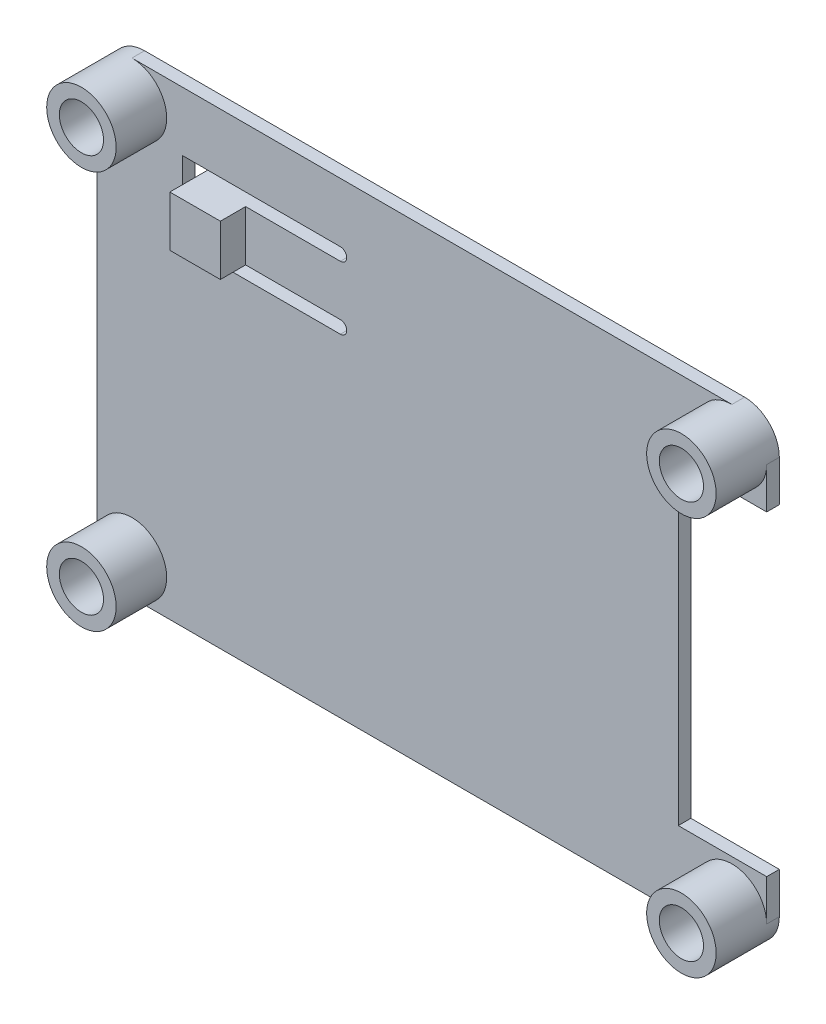
ISO-10303-21;
HEADER;
FILE_DESCRIPTION(('STEP AP214'),'2;1');
FILE_NAME('part.step','',(''),(''),'','','');
FILE_SCHEMA(('AUTOMOTIVE_DESIGN { 1 0 10303 214 1 1 1 1 }'));
ENDSEC;
DATA;
#1=APPLICATION_CONTEXT('core data for automotive mechanical design processes');
#2=APPLICATION_PROTOCOL_DEFINITION('international standard','automotive_design',2000,#1);
#3=PRODUCT_CONTEXT('',#1,'mechanical');
#4=PRODUCT('Part','Part','',(#3));
#5=PRODUCT_RELATED_PRODUCT_CATEGORY('part','',(#4));
#6=PRODUCT_DEFINITION_FORMATION('','',#4);
#7=PRODUCT_DEFINITION_CONTEXT('part definition',#1,'design');
#8=PRODUCT_DEFINITION('design','',#6,#7);
#9=PRODUCT_DEFINITION_SHAPE('','',#8);
#10=(LENGTH_UNIT() NAMED_UNIT(*) SI_UNIT(.MILLI.,.METRE.));
#11=(NAMED_UNIT(*) PLANE_ANGLE_UNIT() SI_UNIT($,.RADIAN.));
#12=(NAMED_UNIT(*) SI_UNIT($,.STERADIAN.) SOLID_ANGLE_UNIT());
#13=UNCERTAINTY_MEASURE_WITH_UNIT(LENGTH_MEASURE(1.E-05),#10,'distance_accuracy_value','');
#14=(GEOMETRIC_REPRESENTATION_CONTEXT(3) GLOBAL_UNCERTAINTY_ASSIGNED_CONTEXT((#13)) GLOBAL_UNIT_ASSIGNED_CONTEXT((#10,
#11,#12)) REPRESENTATION_CONTEXT('',''));
#15=CARTESIAN_POINT('',(0.,0.,0.));
#16=DIRECTION('',(0.,0.,1.));
#17=DIRECTION('',(1.,0.,0.));
#18=AXIS2_PLACEMENT_3D('',#15,#16,#17);
#19=CARTESIAN_POINT('',(0.,0.,1.));
#20=DIRECTION('',(0.,0.,1.));
#21=DIRECTION('',(1.,0.,0.));
#22=AXIS2_PLACEMENT_3D('',#19,#20,#21);
#23=PLANE('',#22);
#24=DIRECTION('',(1.,0.,0.));
#25=VECTOR('',#24,1.);
#26=CARTESIAN_POINT('',(19.5,-12.5,1.));
#27=LINE('',#26,#25);
#28=CARTESIAN_POINT('',(19.5,-12.5,1.));
#29=VERTEX_POINT('',#28);
#30=CARTESIAN_POINT('',(26.5,-12.5,1.));
#31=VERTEX_POINT('',#30);
#32=EDGE_CURVE('E270',#29,#31,#27,.T.);
#33=ORIENTED_EDGE('',*,*,#32,.F.);
#34=DIRECTION('',(0.,-1.,0.));
#35=VECTOR('',#34,1.);
#36=CARTESIAN_POINT('',(19.5,-12.5,1.));
#37=LINE('',#36,#35);
#38=CARTESIAN_POINT('',(19.5,12.5,1.));
#39=VERTEX_POINT('',#38);
#40=EDGE_CURVE('E267',#39,#29,#37,.T.);
#41=ORIENTED_EDGE('',*,*,#40,.F.);
#42=DIRECTION('',(-1.,0.,0.));
#43=VECTOR('',#42,1.);
#44=CARTESIAN_POINT('',(19.5,12.5,1.));
#45=LINE('',#44,#43);
#46=CARTESIAN_POINT('',(26.5,12.5,1.));
#47=VERTEX_POINT('',#46);
#48=EDGE_CURVE('E264',#47,#39,#45,.T.);
#49=ORIENTED_EDGE('',*,*,#48,.F.);
#50=DIRECTION('',(0.,-1.,0.));
#51=VECTOR('',#50,1.);
#52=CARTESIAN_POINT('',(26.5,0.,1.));
#53=LINE('',#52,#51);
#54=CARTESIAN_POINT('',(26.5,15.75,1.));
#55=VERTEX_POINT('',#54);
#56=EDGE_CURVE('E325',#55,#47,#53,.T.);
#57=ORIENTED_EDGE('',*,*,#56,.F.);
#58=CARTESIAN_POINT('',(23.75,15.75,1.));
#59=DIRECTION('',(0.,0.,1.));
#60=DIRECTION('',(1.,0.,0.));
#61=AXIS2_PLACEMENT_3D('',#58,#59,#60);
#62=CIRCLE('',#61,2.75);
#63=CARTESIAN_POINT('',(23.75,18.5,1.));
#64=VERTEX_POINT('',#63);
#65=EDGE_CURVE('E305',#64,#55,#62,.T.);
#66=ORIENTED_EDGE('',*,*,#65,.F.);
#67=DIRECTION('',(1.,0.,0.));
#68=VECTOR('',#67,1.);
#69=CARTESIAN_POINT('',(0.,18.5,1.));
#70=LINE('',#69,#68);
#71=CARTESIAN_POINT('',(-23.75,18.5,1.));
#72=VERTEX_POINT('',#71);
#73=EDGE_CURVE('E328',#72,#64,#70,.T.);
#74=ORIENTED_EDGE('',*,*,#73,.F.);
#75=CARTESIAN_POINT('',(-23.75,15.75,1.));
#76=DIRECTION('',(0.,0.,1.));
#77=DIRECTION('',(1.,0.,0.));
#78=AXIS2_PLACEMENT_3D('',#75,#76,#77);
#79=CIRCLE('',#78,2.75);
#80=CARTESIAN_POINT('',(-26.5,15.75,1.));
#81=VERTEX_POINT('',#80);
#82=EDGE_CURVE('E314',#72,#81,#79,.F.);
#83=ORIENTED_EDGE('',*,*,#82,.T.);
#84=DIRECTION('',(0.,-1.,0.));
#85=VECTOR('',#84,1.);
#86=CARTESIAN_POINT('',(-26.5,0.,1.));
#87=LINE('',#86,#85);
#88=CARTESIAN_POINT('',(-26.5,-15.75,1.));
#89=VERTEX_POINT('',#88);
#90=EDGE_CURVE('E317',#81,#89,#87,.T.);
#91=ORIENTED_EDGE('',*,*,#90,.T.);
#92=CARTESIAN_POINT('',(-23.75,-15.75,1.));
#93=DIRECTION('',(0.,0.,1.));
#94=DIRECTION('',(1.,0.,0.));
#95=AXIS2_PLACEMENT_3D('',#92,#93,#94);
#96=CIRCLE('',#95,2.75);
#97=CARTESIAN_POINT('',(-23.75,-18.5,1.));
#98=VERTEX_POINT('',#97);
#99=EDGE_CURVE('E287',#98,#89,#96,.T.);
#100=ORIENTED_EDGE('',*,*,#99,.F.);
#101=DIRECTION('',(-1.,0.,0.));
#102=VECTOR('',#101,1.);
#103=CARTESIAN_POINT('',(0.,-18.5,1.));
#104=LINE('',#103,#102);
#105=CARTESIAN_POINT('',(23.75,-18.5,1.));
#106=VERTEX_POINT('',#105);
#107=EDGE_CURVE('E320',#106,#98,#104,.T.);
#108=ORIENTED_EDGE('',*,*,#107,.F.);
#109=CARTESIAN_POINT('',(23.75,-15.75,1.));
#110=DIRECTION('',(0.,0.,1.));
#111=DIRECTION('',(1.,0.,0.));
#112=AXIS2_PLACEMENT_3D('',#109,#110,#111);
#113=CIRCLE('',#112,2.75);
#114=CARTESIAN_POINT('',(26.5,-15.75,1.));
#115=VERTEX_POINT('',#114);
#116=EDGE_CURVE('E296',#106,#115,#113,.F.);
#117=ORIENTED_EDGE('',*,*,#116,.T.);
#118=EDGE_CURVE('E324',#31,#115,#53,.T.);
#119=ORIENTED_EDGE('',*,*,#118,.F.);
#120=EDGE_LOOP('',(#33,#41,#49,#57,#66,#74,#83,#91,#100,#108,#117,#119));
#121=FACE_BOUND('',#120,.T.);
#122=DIRECTION('',(1.,0.,0.));
#123=VECTOR('',#122,1.);
#124=CARTESIAN_POINT('',(0.,12.8143313428144,1.));
#125=LINE('',#124,#123);
#126=CARTESIAN_POINT('',(-14.75,12.8143313428144,1.));
#127=VERTEX_POINT('',#126);
#128=CARTESIAN_POINT('',(-7.25,12.8143313428144,1.));
#129=VERTEX_POINT('',#128);
#130=EDGE_CURVE('E237',#127,#129,#125,.T.);
#131=ORIENTED_EDGE('',*,*,#130,.F.);
#132=DIRECTION('',(0.,1.,0.));
#133=VECTOR('',#132,1.);
#134=CARTESIAN_POINT('',(-14.75,8.8143313428144,1.));
#135=LINE('',#134,#133);
#136=CARTESIAN_POINT('',(-14.75,8.8143313428144,1.));
#137=VERTEX_POINT('',#136);
#138=EDGE_CURVE('E51',#137,#127,#135,.T.);
#139=ORIENTED_EDGE('',*,*,#138,.F.);
#140=DIRECTION('',(-1.,0.,0.));
#141=VECTOR('',#140,1.);
#142=CARTESIAN_POINT('',(0.,8.81433134281439,1.));
#143=LINE('',#142,#141);
#144=CARTESIAN_POINT('',(-7.25,8.81433134281439,1.));
#145=VERTEX_POINT('',#144);
#146=EDGE_CURVE('E251',#145,#137,#143,.T.);
#147=ORIENTED_EDGE('',*,*,#146,.F.);
#148=CARTESIAN_POINT('',(-7.25,8.3143313428144,1.));
#149=DIRECTION('',(0.,0.,1.));
#150=DIRECTION('',(1.,0.,0.));
#151=AXIS2_PLACEMENT_3D('',#148,#149,#150);
#152=CIRCLE('',#151,0.5);
#153=CARTESIAN_POINT('',(-7.25,7.8143313428144,1.));
#154=VERTEX_POINT('',#153);
#155=EDGE_CURVE('E254',#154,#145,#152,.T.);
#156=ORIENTED_EDGE('',*,*,#155,.F.);
#157=DIRECTION('',(1.,0.,0.));
#158=VECTOR('',#157,1.);
#159=CARTESIAN_POINT('',(0.,7.81433134281439,1.));
#160=LINE('',#159,#158);
#161=CARTESIAN_POINT('',(-19.75,7.8143313428144,1.));
#162=VERTEX_POINT('',#161);
#163=EDGE_CURVE('E256',#162,#154,#160,.T.);
#164=ORIENTED_EDGE('',*,*,#163,.F.);
#165=DIRECTION('',(0.,-1.,0.));
#166=VECTOR('',#165,1.);
#167=CARTESIAN_POINT('',(-19.75,0.,1.));
#168=LINE('',#167,#166);
#169=CARTESIAN_POINT('',(-19.75,13.8143313428144,1.));
#170=VERTEX_POINT('',#169);
#171=EDGE_CURVE('E258',#170,#162,#168,.T.);
#172=ORIENTED_EDGE('',*,*,#171,.F.);
#173=DIRECTION('',(-1.,0.,0.));
#174=VECTOR('',#173,1.);
#175=CARTESIAN_POINT('',(0.,13.8143313428144,1.));
#176=LINE('',#175,#174);
#177=CARTESIAN_POINT('',(-7.25,13.8143313428144,1.));
#178=VERTEX_POINT('',#177);
#179=EDGE_CURVE('E260',#178,#170,#176,.T.);
#180=ORIENTED_EDGE('',*,*,#179,.F.);
#181=CARTESIAN_POINT('',(-7.25,13.3143313428144,1.));
#182=DIRECTION('',(0.,0.,1.));
#183=DIRECTION('',(1.,0.,0.));
#184=AXIS2_PLACEMENT_3D('',#181,#182,#183);
#185=CIRCLE('',#184,0.5);
#186=EDGE_CURVE('E262',#129,#178,#185,.T.);
#187=ORIENTED_EDGE('',*,*,#186,.F.);
#188=EDGE_LOOP('',(#131,#139,#147,#156,#164,#172,#180,#187));
#189=FACE_BOUND('',#188,.T.);
#190=ADVANCED_FACE('F36',(#121,#189),#23,.T.);
#191=CARTESIAN_POINT('',(26.5,0.,1.));
#192=DIRECTION('',(1.,0.,0.));
#193=DIRECTION('',(0.,0.,-1.));
#194=AXIS2_PLACEMENT_3D('',#191,#192,#193);
#195=PLANE('',#194);
#196=DIRECTION('',(0.,0.,1.));
#197=VECTOR('',#196,1.);
#198=CARTESIAN_POINT('',(26.5,-12.5,-5.));
#199=LINE('',#198,#197);
#200=CARTESIAN_POINT('',(26.5,-12.5,0.));
#201=VERTEX_POINT('',#200);
#202=EDGE_CURVE('E273',#201,#31,#199,.T.);
#203=ORIENTED_EDGE('',*,*,#202,.T.);
#204=ORIENTED_EDGE('',*,*,#118,.T.);
#205=DIRECTION('',(0.,0.,-1.));
#206=VECTOR('',#205,1.);
#207=CARTESIAN_POINT('',(26.5,-15.75,1.));
#208=LINE('',#207,#206);
#209=CARTESIAN_POINT('',(26.5,-15.75,0.));
#210=VERTEX_POINT('',#209);
#211=EDGE_CURVE('E374',#115,#210,#208,.T.);
#212=ORIENTED_EDGE('',*,*,#211,.T.);
#213=DIRECTION('',(0.,-1.,0.));
#214=VECTOR('',#213,1.);
#215=CARTESIAN_POINT('',(26.5,0.,0.));
#216=LINE('',#215,#214);
#217=EDGE_CURVE('E343',#201,#210,#216,.T.);
#218=ORIENTED_EDGE('',*,*,#217,.F.);
#219=EDGE_LOOP('',(#203,#204,#212,#218));
#220=FACE_BOUND('',#219,.T.);
#221=ADVANCED_FACE('F400',(#220),#195,.T.);
#222=CARTESIAN_POINT('',(-26.5,0.,1.));
#223=DIRECTION('',(1.,0.,0.));
#224=DIRECTION('',(0.,1.,0.));
#225=AXIS2_PLACEMENT_3D('',#222,#223,#224);
#226=PLANE('',#225);
#227=DIRECTION('',(0.,-1.,0.));
#228=VECTOR('',#227,1.);
#229=CARTESIAN_POINT('',(-26.5,0.,0.));
#230=LINE('',#229,#228);
#231=CARTESIAN_POINT('',(-26.5,15.75,0.));
#232=VERTEX_POINT('',#231);
#233=CARTESIAN_POINT('',(-26.5,-15.75,0.));
#234=VERTEX_POINT('',#233);
#235=EDGE_CURVE('E316',#232,#234,#230,.T.);
#236=ORIENTED_EDGE('',*,*,#235,.T.);
#237=DIRECTION('',(0.,0.,-1.));
#238=VECTOR('',#237,1.);
#239=CARTESIAN_POINT('',(-26.5,-15.75,1.));
#240=LINE('',#239,#238);
#241=EDGE_CURVE('E381',#89,#234,#240,.T.);
#242=ORIENTED_EDGE('',*,*,#241,.F.);
#243=ORIENTED_EDGE('',*,*,#90,.F.);
#244=DIRECTION('',(0.,0.,-1.));
#245=VECTOR('',#244,1.);
#246=CARTESIAN_POINT('',(-26.5,15.75,1.));
#247=LINE('',#246,#245);
#248=EDGE_CURVE('E331',#81,#232,#247,.T.);
#249=ORIENTED_EDGE('',*,*,#248,.T.);
#250=EDGE_LOOP('',(#236,#242,#243,#249));
#251=FACE_BOUND('',#250,.T.);
#252=ADVANCED_FACE('F38',(#251),#226,.F.);
#253=CARTESIAN_POINT('',(-23.75,-15.75,1.));
#254=DIRECTION('',(0.,0.,-1.));
#255=DIRECTION('',(-1.,0.,0.));
#256=AXIS2_PLACEMENT_3D('',#253,#254,#255);
#257=CYLINDRICAL_SURFACE('',#256,2.75);
#258=CARTESIAN_POINT('',(-23.75,-15.75,0.));
#259=DIRECTION('',(0.,0.,1.));
#260=DIRECTION('',(1.,0.,0.));
#261=AXIS2_PLACEMENT_3D('',#258,#259,#260);
#262=CIRCLE('',#261,2.75);
#263=CARTESIAN_POINT('',(-23.75,-18.5,0.));
#264=VERTEX_POINT('',#263);
#265=EDGE_CURVE('E334',#264,#234,#262,.F.);
#266=ORIENTED_EDGE('',*,*,#265,.F.);
#267=DIRECTION('',(0.,0.,-1.));
#268=VECTOR('',#267,1.);
#269=CARTESIAN_POINT('',(-23.75,-18.5,1.));
#270=LINE('',#269,#268);
#271=EDGE_CURVE('E379',#98,#264,#270,.T.);
#272=ORIENTED_EDGE('',*,*,#271,.F.);
#273=ORIENTED_EDGE('',*,*,#99,.T.);
#274=ORIENTED_EDGE('',*,*,#241,.T.);
#275=EDGE_LOOP('',(#266,#272,#273,#274));
#276=FACE_BOUND('',#275,.T.);
#277=CARTESIAN_POINT('',(-23.75,-15.75,5.));
#278=DIRECTION('',(0.,0.,1.));
#279=DIRECTION('',(1.,0.,0.));
#280=AXIS2_PLACEMENT_3D('',#277,#278,#279);
#281=CIRCLE('',#280,2.75);
#282=CARTESIAN_POINT('',(-21.,-15.75,5.));
#283=VERTEX_POINT('',#282);
#284=EDGE_CURVE('E276',#283,#283,#281,.F.);
#285=ORIENTED_EDGE('',*,*,#284,.T.);
#286=EDGE_LOOP('',(#285));
#287=FACE_BOUND('',#286,.T.);
#288=ADVANCED_FACE('F416',(#276,#287),#257,.T.);
#289=CARTESIAN_POINT('',(0.,-18.5,1.));
#290=DIRECTION('',(0.,-1.,0.));
#291=DIRECTION('',(1.,0.,0.));
#292=AXIS2_PLACEMENT_3D('',#289,#290,#291);
#293=PLANE('',#292);
#294=DIRECTION('',(-1.,0.,0.));
#295=VECTOR('',#294,1.);
#296=CARTESIAN_POINT('',(0.,-18.5,0.));
#297=LINE('',#296,#295);
#298=CARTESIAN_POINT('',(23.75,-18.5,0.));
#299=VERTEX_POINT('',#298);
#300=EDGE_CURVE('E337',#299,#264,#297,.T.);
#301=ORIENTED_EDGE('',*,*,#300,.F.);
#302=DIRECTION('',(0.,0.,-1.));
#303=VECTOR('',#302,1.);
#304=CARTESIAN_POINT('',(23.75,-18.5,1.));
#305=LINE('',#304,#303);
#306=EDGE_CURVE('E377',#106,#299,#305,.T.);
#307=ORIENTED_EDGE('',*,*,#306,.F.);
#308=ORIENTED_EDGE('',*,*,#107,.T.);
#309=ORIENTED_EDGE('',*,*,#271,.T.);
#310=EDGE_LOOP('',(#301,#307,#308,#309));
#311=FACE_BOUND('',#310,.T.);
#312=ADVANCED_FACE('F412',(#311),#293,.T.);
#313=CARTESIAN_POINT('',(23.75,-15.75,1.));
#314=DIRECTION('',(0.,0.,-1.));
#315=DIRECTION('',(-1.,0.,0.));
#316=AXIS2_PLACEMENT_3D('',#313,#314,#315);
#317=CYLINDRICAL_SURFACE('',#316,2.75);
#318=CARTESIAN_POINT('',(23.75,-15.75,0.));
#319=DIRECTION('',(0.,0.,1.));
#320=DIRECTION('',(1.,0.,0.));
#321=AXIS2_PLACEMENT_3D('',#318,#319,#320);
#322=CIRCLE('',#321,2.75);
#323=EDGE_CURVE('E340',#299,#210,#322,.T.);
#324=ORIENTED_EDGE('',*,*,#323,.T.);
#325=ORIENTED_EDGE('',*,*,#211,.F.);
#326=ORIENTED_EDGE('',*,*,#116,.F.);
#327=ORIENTED_EDGE('',*,*,#306,.T.);
#328=EDGE_LOOP('',(#324,#325,#326,#327));
#329=FACE_BOUND('',#328,.T.);
#330=CARTESIAN_POINT('',(23.75,-15.75,5.));
#331=DIRECTION('',(0.,0.,1.));
#332=DIRECTION('',(1.,0.,0.));
#333=AXIS2_PLACEMENT_3D('',#330,#331,#332);
#334=CIRCLE('',#333,2.75);
#335=CARTESIAN_POINT('',(26.5,-15.75,5.));
#336=VERTEX_POINT('',#335);
#337=EDGE_CURVE('E293',#336,#336,#334,.T.);
#338=ORIENTED_EDGE('',*,*,#337,.F.);
#339=EDGE_LOOP('',(#338));
#340=FACE_BOUND('',#339,.T.);
#341=ADVANCED_FACE('F407',(#329,#340),#317,.T.);
#342=DIRECTION('',(0.,0.,1.));
#343=VECTOR('',#342,1.);
#344=CARTESIAN_POINT('',(26.5,12.5,-5.));
#345=LINE('',#344,#343);
#346=CARTESIAN_POINT('',(26.5,12.5,0.));
#347=VERTEX_POINT('',#346);
#348=EDGE_CURVE('E272',#347,#47,#345,.T.);
#349=ORIENTED_EDGE('',*,*,#348,.F.);
#350=CARTESIAN_POINT('',(26.5,15.75,0.));
#351=VERTEX_POINT('',#350);
#352=EDGE_CURVE('E344',#351,#347,#216,.T.);
#353=ORIENTED_EDGE('',*,*,#352,.F.);
#354=DIRECTION('',(0.,0.,-1.));
#355=VECTOR('',#354,1.);
#356=CARTESIAN_POINT('',(26.5,15.75,1.));
#357=LINE('',#356,#355);
#358=EDGE_CURVE('E372',#55,#351,#357,.T.);
#359=ORIENTED_EDGE('',*,*,#358,.F.);
#360=ORIENTED_EDGE('',*,*,#56,.T.);
#361=EDGE_LOOP('',(#349,#353,#359,#360));
#362=FACE_BOUND('',#361,.T.);
#363=ADVANCED_FACE('F441',(#362),#195,.T.);
#364=CARTESIAN_POINT('',(23.75,15.75,1.));
#365=DIRECTION('',(0.,0.,-1.));
#366=DIRECTION('',(-1.,0.,0.));
#367=AXIS2_PLACEMENT_3D('',#364,#365,#366);
#368=CYLINDRICAL_SURFACE('',#367,2.75);
#369=CARTESIAN_POINT('',(23.75,15.75,0.));
#370=DIRECTION('',(0.,0.,1.));
#371=DIRECTION('',(1.,0.,0.));
#372=AXIS2_PLACEMENT_3D('',#369,#370,#371);
#373=CIRCLE('',#372,2.75);
#374=CARTESIAN_POINT('',(23.75,18.5,0.));
#375=VERTEX_POINT('',#374);
#376=EDGE_CURVE('E347',#375,#351,#373,.F.);
#377=ORIENTED_EDGE('',*,*,#376,.F.);
#378=DIRECTION('',(0.,0.,-1.));
#379=VECTOR('',#378,1.);
#380=CARTESIAN_POINT('',(23.75,18.5,1.));
#381=LINE('',#380,#379);
#382=EDGE_CURVE('E370',#64,#375,#381,.T.);
#383=ORIENTED_EDGE('',*,*,#382,.F.);
#384=ORIENTED_EDGE('',*,*,#65,.T.);
#385=ORIENTED_EDGE('',*,*,#358,.T.);
#386=EDGE_LOOP('',(#377,#383,#384,#385));
#387=FACE_BOUND('',#386,.T.);
#388=CARTESIAN_POINT('',(23.75,15.75,5.));
#389=DIRECTION('',(0.,0.,1.));
#390=DIRECTION('',(1.,0.,0.));
#391=AXIS2_PLACEMENT_3D('',#388,#389,#390);
#392=CIRCLE('',#391,2.75);
#393=CARTESIAN_POINT('',(26.5,15.75,5.));
#394=VERTEX_POINT('',#393);
#395=EDGE_CURVE('E299',#394,#394,#392,.F.);
#396=ORIENTED_EDGE('',*,*,#395,.T.);
#397=EDGE_LOOP('',(#396));
#398=FACE_BOUND('',#397,.T.);
#399=ADVANCED_FACE('F436',(#387,#398),#368,.T.);
#400=CARTESIAN_POINT('',(0.,18.5,1.));
#401=DIRECTION('',(0.,1.,0.));
#402=DIRECTION('',(-1.,0.,0.));
#403=AXIS2_PLACEMENT_3D('',#400,#401,#402);
#404=PLANE('',#403);
#405=DIRECTION('',(1.,0.,0.));
#406=VECTOR('',#405,1.);
#407=CARTESIAN_POINT('',(0.,18.5,0.));
#408=LINE('',#407,#406);
#409=CARTESIAN_POINT('',(-23.75,18.5,0.));
#410=VERTEX_POINT('',#409);
#411=EDGE_CURVE('E350',#410,#375,#408,.T.);
#412=ORIENTED_EDGE('',*,*,#411,.F.);
#413=DIRECTION('',(0.,0.,-1.));
#414=VECTOR('',#413,1.);
#415=CARTESIAN_POINT('',(-23.75,18.5,1.));
#416=LINE('',#415,#414);
#417=EDGE_CURVE('E368',#72,#410,#416,.T.);
#418=ORIENTED_EDGE('',*,*,#417,.F.);
#419=ORIENTED_EDGE('',*,*,#73,.T.);
#420=ORIENTED_EDGE('',*,*,#382,.T.);
#421=EDGE_LOOP('',(#412,#418,#419,#420));
#422=FACE_BOUND('',#421,.T.);
#423=ADVANCED_FACE('F430',(#422),#404,.T.);
#424=CARTESIAN_POINT('',(23.75,-15.75,1.));
#425=DIRECTION('',(0.,0.,-1.));
#426=DIRECTION('',(-1.,0.,0.));
#427=AXIS2_PLACEMENT_3D('',#424,#425,#426);
#428=CYLINDRICAL_SURFACE('',#427,1.75);
#429=CARTESIAN_POINT('',(23.75,-15.75,0.));
#430=DIRECTION('',(0.,0.,1.));
#431=DIRECTION('',(1.,0.,0.));
#432=AXIS2_PLACEMENT_3D('',#429,#430,#431);
#433=CIRCLE('',#432,1.75);
#434=CARTESIAN_POINT('',(25.5,-15.75,0.));
#435=VERTEX_POINT('',#434);
#436=EDGE_CURVE('E361',#435,#435,#433,.T.);
#437=ORIENTED_EDGE('',*,*,#436,.F.);
#438=EDGE_LOOP('',(#437));
#439=FACE_BOUND('',#438,.T.);
#440=CARTESIAN_POINT('',(23.75,-15.75,5.));
#441=DIRECTION('',(0.,0.,1.));
#442=DIRECTION('',(1.,0.,0.));
#443=AXIS2_PLACEMENT_3D('',#440,#441,#442);
#444=CIRCLE('',#443,1.75);
#445=CARTESIAN_POINT('',(25.5,-15.75,5.));
#446=VERTEX_POINT('',#445);
#447=EDGE_CURVE('E290',#446,#446,#444,.T.);
#448=ORIENTED_EDGE('',*,*,#447,.T.);
#449=EDGE_LOOP('',(#448));
#450=FACE_BOUND('',#449,.T.);
#451=ADVANCED_FACE('F472',(#439,#450),#428,.F.);
#452=CARTESIAN_POINT('',(23.75,15.75,1.));
#453=DIRECTION('',(0.,0.,-1.));
#454=DIRECTION('',(-1.,0.,0.));
#455=AXIS2_PLACEMENT_3D('',#452,#453,#454);
#456=CYLINDRICAL_SURFACE('',#455,1.75);
#457=CARTESIAN_POINT('',(23.75,15.75,0.));
#458=DIRECTION('',(0.,0.,1.));
#459=DIRECTION('',(1.,0.,0.));
#460=AXIS2_PLACEMENT_3D('',#457,#458,#459);
#461=CIRCLE('',#460,1.75);
#462=CARTESIAN_POINT('',(25.5,15.75,0.));
#463=VERTEX_POINT('',#462);
#464=EDGE_CURVE('E358',#463,#463,#461,.F.);
#465=ORIENTED_EDGE('',*,*,#464,.T.);
#466=EDGE_LOOP('',(#465));
#467=FACE_BOUND('',#466,.T.);
#468=CARTESIAN_POINT('',(23.75,15.75,5.));
#469=DIRECTION('',(0.,0.,1.));
#470=DIRECTION('',(1.,0.,0.));
#471=AXIS2_PLACEMENT_3D('',#468,#469,#470);
#472=CIRCLE('',#471,1.75);
#473=CARTESIAN_POINT('',(25.5,15.75,5.));
#474=VERTEX_POINT('',#473);
#475=EDGE_CURVE('E302',#474,#474,#472,.F.);
#476=ORIENTED_EDGE('',*,*,#475,.F.);
#477=EDGE_LOOP('',(#476));
#478=FACE_BOUND('',#477,.T.);
#479=ADVANCED_FACE('F475',(#467,#478),#456,.F.);
#480=CARTESIAN_POINT('',(-23.75,15.75,1.));
#481=DIRECTION('',(0.,0.,-1.));
#482=DIRECTION('',(-1.,0.,0.));
#483=AXIS2_PLACEMENT_3D('',#480,#481,#482);
#484=CYLINDRICAL_SURFACE('',#483,1.75);
#485=CARTESIAN_POINT('',(-23.75,15.75,0.));
#486=DIRECTION('',(0.,0.,1.));
#487=DIRECTION('',(1.,0.,0.));
#488=AXIS2_PLACEMENT_3D('',#485,#486,#487);
#489=CIRCLE('',#488,1.75);
#490=CARTESIAN_POINT('',(-22.,15.75,0.));
#491=VERTEX_POINT('',#490);
#492=EDGE_CURVE('E355',#491,#491,#489,.T.);
#493=ORIENTED_EDGE('',*,*,#492,.F.);
#494=EDGE_LOOP('',(#493));
#495=FACE_BOUND('',#494,.T.);
#496=CARTESIAN_POINT('',(-23.75,15.75,5.));
#497=DIRECTION('',(0.,0.,1.));
#498=DIRECTION('',(1.,0.,0.));
#499=AXIS2_PLACEMENT_3D('',#496,#497,#498);
#500=CIRCLE('',#499,1.75);
#501=CARTESIAN_POINT('',(-22.,15.75,5.));
#502=VERTEX_POINT('',#501);
#503=EDGE_CURVE('E308',#502,#502,#500,.T.);
#504=ORIENTED_EDGE('',*,*,#503,.T.);
#505=EDGE_LOOP('',(#504));
#506=FACE_BOUND('',#505,.T.);
#507=ADVANCED_FACE('F479',(#495,#506),#484,.F.);
#508=CARTESIAN_POINT('',(-23.75,15.75,1.));
#509=DIRECTION('',(0.,0.,-1.));
#510=DIRECTION('',(-1.,0.,0.));
#511=AXIS2_PLACEMENT_3D('',#508,#509,#510);
#512=CYLINDRICAL_SURFACE('',#511,2.75);
#513=CARTESIAN_POINT('',(-23.75,15.75,0.));
#514=DIRECTION('',(0.,0.,1.));
#515=DIRECTION('',(1.,0.,0.));
#516=AXIS2_PLACEMENT_3D('',#513,#514,#515);
#517=CIRCLE('',#516,2.75);
#518=EDGE_CURVE('E353',#410,#232,#517,.T.);
#519=ORIENTED_EDGE('',*,*,#518,.T.);
#520=ORIENTED_EDGE('',*,*,#248,.F.);
#521=ORIENTED_EDGE('',*,*,#82,.F.);
#522=ORIENTED_EDGE('',*,*,#417,.T.);
#523=EDGE_LOOP('',(#519,#520,#521,#522));
#524=FACE_BOUND('',#523,.T.);
#525=CARTESIAN_POINT('',(-23.75,15.75,5.));
#526=DIRECTION('',(0.,0.,1.));
#527=DIRECTION('',(1.,0.,0.));
#528=AXIS2_PLACEMENT_3D('',#525,#526,#527);
#529=CIRCLE('',#528,2.75);
#530=CARTESIAN_POINT('',(-21.,15.75,5.));
#531=VERTEX_POINT('',#530);
#532=EDGE_CURVE('E311',#531,#531,#529,.T.);
#533=ORIENTED_EDGE('',*,*,#532,.F.);
#534=EDGE_LOOP('',(#533));
#535=FACE_BOUND('',#534,.T.);
#536=ADVANCED_FACE('F425',(#524,#535),#512,.T.);
#537=CARTESIAN_POINT('',(-23.75,-15.75,1.));
#538=DIRECTION('',(0.,0.,-1.));
#539=DIRECTION('',(-1.,0.,0.));
#540=AXIS2_PLACEMENT_3D('',#537,#538,#539);
#541=CYLINDRICAL_SURFACE('',#540,1.75);
#542=CARTESIAN_POINT('',(-23.75,-15.75,0.));
#543=DIRECTION('',(0.,0.,1.));
#544=DIRECTION('',(1.,0.,0.));
#545=AXIS2_PLACEMENT_3D('',#542,#543,#544);
#546=CIRCLE('',#545,1.75);
#547=CARTESIAN_POINT('',(-22.,-15.75,0.));
#548=VERTEX_POINT('',#547);
#549=EDGE_CURVE('E321',#548,#548,#546,.F.);
#550=ORIENTED_EDGE('',*,*,#549,.T.);
#551=EDGE_LOOP('',(#550));
#552=FACE_BOUND('',#551,.T.);
#553=CARTESIAN_POINT('',(-23.75,-15.75,5.));
#554=DIRECTION('',(0.,0.,1.));
#555=DIRECTION('',(1.,0.,0.));
#556=AXIS2_PLACEMENT_3D('',#553,#554,#555);
#557=CIRCLE('',#556,1.75);
#558=CARTESIAN_POINT('',(-22.,-15.75,5.));
#559=VERTEX_POINT('',#558);
#560=EDGE_CURVE('E284',#559,#559,#557,.F.);
#561=ORIENTED_EDGE('',*,*,#560,.F.);
#562=EDGE_LOOP('',(#561));
#563=FACE_BOUND('',#562,.T.);
#564=ADVANCED_FACE('F467',(#552,#563),#541,.F.);
#565=CARTESIAN_POINT('',(0.,0.,0.));
#566=DIRECTION('',(0.,0.,1.));
#567=DIRECTION('',(1.,0.,0.));
#568=AXIS2_PLACEMENT_3D('',#565,#566,#567);
#569=PLANE('',#568);
#570=DIRECTION('',(-1.,0.,0.));
#571=VECTOR('',#570,1.);
#572=CARTESIAN_POINT('',(-7.25,12.8143313428144,0.));
#573=LINE('',#572,#571);
#574=CARTESIAN_POINT('',(-7.25,12.8143313428144,0.));
#575=VERTEX_POINT('',#574);
#576=CARTESIAN_POINT('',(-18.75,12.8143313428144,0.));
#577=VERTEX_POINT('',#576);
#578=EDGE_CURVE('E207',#575,#577,#573,.T.);
#579=ORIENTED_EDGE('',*,*,#578,.F.);
#580=CARTESIAN_POINT('',(-7.25,13.3143313428144,0.));
#581=DIRECTION('',(0.,0.,-1.));
#582=DIRECTION('',(1.,0.,0.));
#583=AXIS2_PLACEMENT_3D('',#580,#581,#582);
#584=CIRCLE('',#583,0.5);
#585=CARTESIAN_POINT('',(-7.25,13.8143313428144,0.));
#586=VERTEX_POINT('',#585);
#587=EDGE_CURVE('E59',#586,#575,#584,.T.);
#588=ORIENTED_EDGE('',*,*,#587,.F.);
#589=DIRECTION('',(1.,0.,0.));
#590=VECTOR('',#589,1.);
#591=CARTESIAN_POINT('',(-7.25,13.8143313428144,0.));
#592=LINE('',#591,#590);
#593=CARTESIAN_POINT('',(-19.75,13.8143313428144,0.));
#594=VERTEX_POINT('',#593);
#595=EDGE_CURVE('E231',#594,#586,#592,.T.);
#596=ORIENTED_EDGE('',*,*,#595,.F.);
#597=DIRECTION('',(0.,1.,0.));
#598=VECTOR('',#597,1.);
#599=CARTESIAN_POINT('',(-19.75,13.8143313428144,0.));
#600=LINE('',#599,#598);
#601=CARTESIAN_POINT('',(-19.75,7.8143313428144,0.));
#602=VERTEX_POINT('',#601);
#603=EDGE_CURVE('E228',#602,#594,#600,.T.);
#604=ORIENTED_EDGE('',*,*,#603,.F.);
#605=DIRECTION('',(-1.,0.,0.));
#606=VECTOR('',#605,1.);
#607=CARTESIAN_POINT('',(-19.75,7.8143313428144,0.));
#608=LINE('',#607,#606);
#609=CARTESIAN_POINT('',(-7.25,7.8143313428144,0.));
#610=VERTEX_POINT('',#609);
#611=EDGE_CURVE('E225',#610,#602,#608,.T.);
#612=ORIENTED_EDGE('',*,*,#611,.F.);
#613=CARTESIAN_POINT('',(-7.25,8.3143313428144,0.));
#614=DIRECTION('',(0.,0.,-1.));
#615=DIRECTION('',(-1.,0.,0.));
#616=AXIS2_PLACEMENT_3D('',#613,#614,#615);
#617=CIRCLE('',#616,0.5);
#618=CARTESIAN_POINT('',(-7.25,8.81433134281439,0.));
#619=VERTEX_POINT('',#618);
#620=EDGE_CURVE('E222',#619,#610,#617,.T.);
#621=ORIENTED_EDGE('',*,*,#620,.F.);
#622=DIRECTION('',(1.,0.,0.));
#623=VECTOR('',#622,1.);
#624=CARTESIAN_POINT('',(-18.75,8.8143313428144,0.));
#625=LINE('',#624,#623);
#626=CARTESIAN_POINT('',(-18.75,8.8143313428144,0.));
#627=VERTEX_POINT('',#626);
#628=EDGE_CURVE('E219',#627,#619,#625,.T.);
#629=ORIENTED_EDGE('',*,*,#628,.F.);
#630=DIRECTION('',(0.,-1.,0.));
#631=VECTOR('',#630,1.);
#632=CARTESIAN_POINT('',(-18.75,12.8143313428144,0.));
#633=LINE('',#632,#631);
#634=EDGE_CURVE('E216',#577,#627,#633,.T.);
#635=ORIENTED_EDGE('',*,*,#634,.F.);
#636=EDGE_LOOP('',(#579,#588,#596,#604,#612,#621,#629,#635));
#637=FACE_BOUND('',#636,.T.);
#638=DIRECTION('',(0.,-1.,0.));
#639=VECTOR('',#638,1.);
#640=CARTESIAN_POINT('',(19.5,0.,0.));
#641=LINE('',#640,#639);
#642=CARTESIAN_POINT('',(19.5,12.5,0.));
#643=VERTEX_POINT('',#642);
#644=CARTESIAN_POINT('',(19.5,-12.5,0.));
#645=VERTEX_POINT('',#644);
#646=EDGE_CURVE('E44',#643,#645,#641,.T.);
#647=ORIENTED_EDGE('',*,*,#646,.T.);
#648=DIRECTION('',(1.,0.,0.));
#649=VECTOR('',#648,1.);
#650=CARTESIAN_POINT('',(0.,-12.5,0.));
#651=LINE('',#650,#649);
#652=EDGE_CURVE('E12',#645,#201,#651,.T.);
#653=ORIENTED_EDGE('',*,*,#652,.T.);
#654=ORIENTED_EDGE('',*,*,#217,.T.);
#655=ORIENTED_EDGE('',*,*,#323,.F.);
#656=ORIENTED_EDGE('',*,*,#300,.T.);
#657=ORIENTED_EDGE('',*,*,#265,.T.);
#658=ORIENTED_EDGE('',*,*,#235,.F.);
#659=ORIENTED_EDGE('',*,*,#518,.F.);
#660=ORIENTED_EDGE('',*,*,#411,.T.);
#661=ORIENTED_EDGE('',*,*,#376,.T.);
#662=ORIENTED_EDGE('',*,*,#352,.T.);
#663=DIRECTION('',(-1.,0.,0.));
#664=VECTOR('',#663,1.);
#665=CARTESIAN_POINT('',(0.,12.5,0.));
#666=LINE('',#665,#664);
#667=EDGE_CURVE('E383',#347,#643,#666,.T.);
#668=ORIENTED_EDGE('',*,*,#667,.T.);
#669=EDGE_LOOP('',(#647,#653,#654,#655,#656,#657,#658,#659,#660,#661,#662,#668));
#670=FACE_BOUND('',#669,.T.);
#671=ORIENTED_EDGE('',*,*,#492,.T.);
#672=EDGE_LOOP('',(#671));
#673=FACE_BOUND('',#672,.T.);
#674=ORIENTED_EDGE('',*,*,#464,.F.);
#675=EDGE_LOOP('',(#674));
#676=FACE_BOUND('',#675,.T.);
#677=ORIENTED_EDGE('',*,*,#436,.T.);
#678=EDGE_LOOP('',(#677));
#679=FACE_BOUND('',#678,.T.);
#680=ORIENTED_EDGE('',*,*,#549,.F.);
#681=EDGE_LOOP('',(#680));
#682=FACE_BOUND('',#681,.T.);
#683=ADVANCED_FACE('F388',(#637,#670,#673,#676,#679,#682),#569,.F.);
#684=CARTESIAN_POINT('',(0.,0.,5.));
#685=DIRECTION('',(0.,0.,1.));
#686=DIRECTION('',(1.,0.,0.));
#687=AXIS2_PLACEMENT_3D('',#684,#685,#686);
#688=PLANE('',#687);
#689=ORIENTED_EDGE('',*,*,#503,.F.);
#690=EDGE_LOOP('',(#689));
#691=FACE_BOUND('',#690,.T.);
#692=ORIENTED_EDGE('',*,*,#532,.T.);
#693=EDGE_LOOP('',(#692));
#694=FACE_BOUND('',#693,.T.);
#695=ADVANCED_FACE('F463',(#691,#694),#688,.T.);
#696=CARTESIAN_POINT('',(0.,0.,5.));
#697=DIRECTION('',(0.,0.,1.));
#698=DIRECTION('',(1.,0.,0.));
#699=AXIS2_PLACEMENT_3D('',#696,#697,#698);
#700=PLANE('',#699);
#701=ORIENTED_EDGE('',*,*,#395,.F.);
#702=EDGE_LOOP('',(#701));
#703=FACE_BOUND('',#702,.T.);
#704=ORIENTED_EDGE('',*,*,#475,.T.);
#705=EDGE_LOOP('',(#704));
#706=FACE_BOUND('',#705,.T.);
#707=ADVANCED_FACE('F686',(#703,#706),#700,.T.);
#708=CARTESIAN_POINT('',(0.,0.,5.));
#709=DIRECTION('',(0.,0.,1.));
#710=DIRECTION('',(1.,0.,0.));
#711=AXIS2_PLACEMENT_3D('',#708,#709,#710);
#712=PLANE('',#711);
#713=ORIENTED_EDGE('',*,*,#447,.F.);
#714=EDGE_LOOP('',(#713));
#715=FACE_BOUND('',#714,.T.);
#716=ORIENTED_EDGE('',*,*,#337,.T.);
#717=EDGE_LOOP('',(#716));
#718=FACE_BOUND('',#717,.T.);
#719=ADVANCED_FACE('F693',(#715,#718),#712,.T.);
#720=CARTESIAN_POINT('',(0.,0.,5.));
#721=DIRECTION('',(0.,0.,1.));
#722=DIRECTION('',(1.,0.,0.));
#723=AXIS2_PLACEMENT_3D('',#720,#721,#722);
#724=PLANE('',#723);
#725=ORIENTED_EDGE('',*,*,#284,.F.);
#726=EDGE_LOOP('',(#725));
#727=FACE_BOUND('',#726,.T.);
#728=ORIENTED_EDGE('',*,*,#560,.T.);
#729=EDGE_LOOP('',(#728));
#730=FACE_BOUND('',#729,.T.);
#731=ADVANCED_FACE('F512',(#727,#730),#724,.T.);
#732=CARTESIAN_POINT('',(19.5,-12.5,-5.));
#733=DIRECTION('',(0.,-1.,0.));
#734=DIRECTION('',(0.,0.,-1.));
#735=AXIS2_PLACEMENT_3D('',#732,#733,#734);
#736=PLANE('',#735);
#737=DIRECTION('',(0.,0.,1.));
#738=VECTOR('',#737,1.);
#739=CARTESIAN_POINT('',(19.5,-12.5,-5.));
#740=LINE('',#739,#738);
#741=EDGE_CURVE('E277',#645,#29,#740,.T.);
#742=ORIENTED_EDGE('',*,*,#741,.T.);
#743=ORIENTED_EDGE('',*,*,#32,.T.);
#744=ORIENTED_EDGE('',*,*,#202,.F.);
#745=ORIENTED_EDGE('',*,*,#652,.F.);
#746=EDGE_LOOP('',(#742,#743,#744,#745));
#747=FACE_BOUND('',#746,.T.);
#748=ADVANCED_FACE('F397',(#747),#736,.F.);
#749=CARTESIAN_POINT('',(19.5,-12.5,-5.));
#750=DIRECTION('',(-1.,0.,0.));
#751=DIRECTION('',(0.,0.,1.));
#752=AXIS2_PLACEMENT_3D('',#749,#750,#751);
#753=PLANE('',#752);
#754=DIRECTION('',(0.,0.,1.));
#755=VECTOR('',#754,1.);
#756=CARTESIAN_POINT('',(19.5,12.5,-5.));
#757=LINE('',#756,#755);
#758=EDGE_CURVE('E279',#643,#39,#757,.T.);
#759=ORIENTED_EDGE('',*,*,#758,.T.);
#760=ORIENTED_EDGE('',*,*,#40,.T.);
#761=ORIENTED_EDGE('',*,*,#741,.F.);
#762=ORIENTED_EDGE('',*,*,#646,.F.);
#763=EDGE_LOOP('',(#759,#760,#761,#762));
#764=FACE_BOUND('',#763,.T.);
#765=ADVANCED_FACE('F393',(#764),#753,.F.);
#766=CARTESIAN_POINT('',(19.5,12.5,-5.));
#767=DIRECTION('',(0.,1.,0.));
#768=DIRECTION('',(0.,0.,1.));
#769=AXIS2_PLACEMENT_3D('',#766,#767,#768);
#770=PLANE('',#769);
#771=ORIENTED_EDGE('',*,*,#348,.T.);
#772=ORIENTED_EDGE('',*,*,#48,.T.);
#773=ORIENTED_EDGE('',*,*,#758,.F.);
#774=ORIENTED_EDGE('',*,*,#667,.F.);
#775=EDGE_LOOP('',(#771,#772,#773,#774));
#776=FACE_BOUND('',#775,.T.);
#777=ADVANCED_FACE('F443',(#776),#770,.F.);
#778=CARTESIAN_POINT('',(-7.25,13.3143313428144,6.));
#779=DIRECTION('',(0.,0.,-1.));
#780=DIRECTION('',(-1.,0.,0.));
#781=AXIS2_PLACEMENT_3D('',#778,#779,#780);
#782=CYLINDRICAL_SURFACE('',#781,0.5);
#783=ORIENTED_EDGE('',*,*,#186,.T.);
#784=DIRECTION('',(0.,0.,-1.));
#785=VECTOR('',#784,1.);
#786=CARTESIAN_POINT('',(-7.25,13.8143313428144,6.));
#787=LINE('',#786,#785);
#788=EDGE_CURVE('E235',#178,#586,#787,.T.);
#789=ORIENTED_EDGE('',*,*,#788,.T.);
#790=ORIENTED_EDGE('',*,*,#587,.T.);
#791=DIRECTION('',(0.,0.,-1.));
#792=VECTOR('',#791,1.);
#793=CARTESIAN_POINT('',(-7.25,12.8143313428144,6.));
#794=LINE('',#793,#792);
#795=EDGE_CURVE('E234',#129,#575,#794,.T.);
#796=ORIENTED_EDGE('',*,*,#795,.F.);
#797=EDGE_LOOP('',(#783,#789,#790,#796));
#798=FACE_BOUND('',#797,.T.);
#799=ADVANCED_FACE('F445',(#798),#782,.F.);
#800=CARTESIAN_POINT('',(-7.25,13.8143313428144,6.));
#801=DIRECTION('',(0.,1.,0.));
#802=DIRECTION('',(0.,0.,1.));
#803=AXIS2_PLACEMENT_3D('',#800,#801,#802);
#804=PLANE('',#803);
#805=ORIENTED_EDGE('',*,*,#179,.T.);
#806=DIRECTION('',(0.,0.,-1.));
#807=VECTOR('',#806,1.);
#808=CARTESIAN_POINT('',(-19.75,13.8143313428144,6.));
#809=LINE('',#808,#807);
#810=EDGE_CURVE('E238',#170,#594,#809,.T.);
#811=ORIENTED_EDGE('',*,*,#810,.T.);
#812=ORIENTED_EDGE('',*,*,#595,.T.);
#813=ORIENTED_EDGE('',*,*,#788,.F.);
#814=EDGE_LOOP('',(#805,#811,#812,#813));
#815=FACE_BOUND('',#814,.T.);
#816=ADVANCED_FACE('F451',(#815),#804,.F.);
#817=CARTESIAN_POINT('',(-19.75,13.8143313428144,6.));
#818=DIRECTION('',(-1.,0.,0.));
#819=DIRECTION('',(0.,0.,1.));
#820=AXIS2_PLACEMENT_3D('',#817,#818,#819);
#821=PLANE('',#820);
#822=ORIENTED_EDGE('',*,*,#171,.T.);
#823=DIRECTION('',(0.,0.,-1.));
#824=VECTOR('',#823,1.);
#825=CARTESIAN_POINT('',(-19.75,7.8143313428144,6.));
#826=LINE('',#825,#824);
#827=EDGE_CURVE('E240',#162,#602,#826,.T.);
#828=ORIENTED_EDGE('',*,*,#827,.T.);
#829=ORIENTED_EDGE('',*,*,#603,.T.);
#830=ORIENTED_EDGE('',*,*,#810,.F.);
#831=EDGE_LOOP('',(#822,#828,#829,#830));
#832=FACE_BOUND('',#831,.T.);
#833=ADVANCED_FACE('F560',(#832),#821,.F.);
#834=CARTESIAN_POINT('',(-19.75,7.8143313428144,6.));
#835=DIRECTION('',(0.,-1.,0.));
#836=DIRECTION('',(1.,0.,0.));
#837=AXIS2_PLACEMENT_3D('',#834,#835,#836);
#838=PLANE('',#837);
#839=ORIENTED_EDGE('',*,*,#163,.T.);
#840=DIRECTION('',(0.,0.,-1.));
#841=VECTOR('',#840,1.);
#842=CARTESIAN_POINT('',(-7.25,7.8143313428144,6.));
#843=LINE('',#842,#841);
#844=EDGE_CURVE('E242',#154,#610,#843,.T.);
#845=ORIENTED_EDGE('',*,*,#844,.T.);
#846=ORIENTED_EDGE('',*,*,#611,.T.);
#847=ORIENTED_EDGE('',*,*,#827,.F.);
#848=EDGE_LOOP('',(#839,#845,#846,#847));
#849=FACE_BOUND('',#848,.T.);
#850=ADVANCED_FACE('F570',(#849),#838,.F.);
#851=CARTESIAN_POINT('',(-7.25,8.3143313428144,6.));
#852=DIRECTION('',(0.,0.,-1.));
#853=DIRECTION('',(-1.,0.,0.));
#854=AXIS2_PLACEMENT_3D('',#851,#852,#853);
#855=CYLINDRICAL_SURFACE('',#854,0.5);
#856=ORIENTED_EDGE('',*,*,#155,.T.);
#857=DIRECTION('',(0.,0.,-1.));
#858=VECTOR('',#857,1.);
#859=CARTESIAN_POINT('',(-7.25,8.81433134281439,6.));
#860=LINE('',#859,#858);
#861=EDGE_CURVE('E244',#145,#619,#860,.T.);
#862=ORIENTED_EDGE('',*,*,#861,.T.);
#863=ORIENTED_EDGE('',*,*,#620,.T.);
#864=ORIENTED_EDGE('',*,*,#844,.F.);
#865=EDGE_LOOP('',(#856,#862,#863,#864));
#866=FACE_BOUND('',#865,.T.);
#867=ADVANCED_FACE('F580',(#866),#855,.F.);
#868=CARTESIAN_POINT('',(-18.75,8.8143313428144,6.));
#869=DIRECTION('',(0.,1.,0.));
#870=DIRECTION('',(-1.,0.,0.));
#871=AXIS2_PLACEMENT_3D('',#868,#869,#870);
#872=PLANE('',#871);
#873=ORIENTED_EDGE('',*,*,#146,.T.);
#874=DIRECTION('',(0.,0.,-1.));
#875=VECTOR('',#874,1.);
#876=CARTESIAN_POINT('',(-14.75,8.8143313428144,10.6568542494924));
#877=LINE('',#876,#875);
#878=CARTESIAN_POINT('',(-14.75,8.8143313428144,3.));
#879=VERTEX_POINT('',#878);
#880=EDGE_CURVE('E213',#879,#137,#877,.T.);
#881=ORIENTED_EDGE('',*,*,#880,.F.);
#882=DIRECTION('',(1.,0.,0.));
#883=VECTOR('',#882,1.);
#884=CARTESIAN_POINT('',(-18.75,8.8143313428144,3.));
#885=LINE('',#884,#883);
#886=CARTESIAN_POINT('',(-18.75,8.8143313428144,3.));
#887=VERTEX_POINT('',#886);
#888=EDGE_CURVE('E205',#887,#879,#885,.T.);
#889=ORIENTED_EDGE('',*,*,#888,.F.);
#890=DIRECTION('',(0.,0.,-1.));
#891=VECTOR('',#890,1.);
#892=CARTESIAN_POINT('',(-18.75,8.8143313428144,6.));
#893=LINE('',#892,#891);
#894=EDGE_CURVE('E246',#887,#627,#893,.T.);
#895=ORIENTED_EDGE('',*,*,#894,.T.);
#896=ORIENTED_EDGE('',*,*,#628,.T.);
#897=ORIENTED_EDGE('',*,*,#861,.F.);
#898=EDGE_LOOP('',(#873,#881,#889,#895,#896,#897));
#899=FACE_BOUND('',#898,.T.);
#900=ADVANCED_FACE('F589',(#899),#872,.F.);
#901=CARTESIAN_POINT('',(-18.75,12.8143313428144,6.));
#902=DIRECTION('',(1.,0.,0.));
#903=DIRECTION('',(0.,0.,-1.));
#904=AXIS2_PLACEMENT_3D('',#901,#902,#903);
#905=PLANE('',#904);
#906=ORIENTED_EDGE('',*,*,#894,.F.);
#907=DIRECTION('',(0.,-1.,0.));
#908=VECTOR('',#907,1.);
#909=CARTESIAN_POINT('',(-18.75,8.8143313428144,3.));
#910=LINE('',#909,#908);
#911=CARTESIAN_POINT('',(-18.75,12.8143313428144,3.));
#912=VERTEX_POINT('',#911);
#913=EDGE_CURVE('E200',#912,#887,#910,.T.);
#914=ORIENTED_EDGE('',*,*,#913,.F.);
#915=DIRECTION('',(0.,0.,-1.));
#916=VECTOR('',#915,1.);
#917=CARTESIAN_POINT('',(-18.75,12.8143313428144,6.));
#918=LINE('',#917,#916);
#919=EDGE_CURVE('E196',#912,#577,#918,.T.);
#920=ORIENTED_EDGE('',*,*,#919,.T.);
#921=ORIENTED_EDGE('',*,*,#634,.T.);
#922=EDGE_LOOP('',(#906,#914,#920,#921));
#923=FACE_BOUND('',#922,.T.);
#924=ADVANCED_FACE('F606',(#923),#905,.F.);
#925=CARTESIAN_POINT('',(-7.25,12.8143313428144,6.));
#926=DIRECTION('',(0.,-1.,0.));
#927=DIRECTION('',(0.,0.,-1.));
#928=AXIS2_PLACEMENT_3D('',#925,#926,#927);
#929=PLANE('',#928);
#930=ORIENTED_EDGE('',*,*,#919,.F.);
#931=DIRECTION('',(-1.,0.,0.));
#932=VECTOR('',#931,1.);
#933=CARTESIAN_POINT('',(-18.75,12.8143313428144,3.));
#934=LINE('',#933,#932);
#935=CARTESIAN_POINT('',(-14.75,12.8143313428144,3.));
#936=VERTEX_POINT('',#935);
#937=EDGE_CURVE('E191',#936,#912,#934,.T.);
#938=ORIENTED_EDGE('',*,*,#937,.F.);
#939=DIRECTION('',(0.,0.,-1.));
#940=VECTOR('',#939,1.);
#941=CARTESIAN_POINT('',(-14.75,12.8143313428144,10.6568542494924));
#942=LINE('',#941,#940);
#943=EDGE_CURVE('E183',#936,#127,#942,.T.);
#944=ORIENTED_EDGE('',*,*,#943,.T.);
#945=ORIENTED_EDGE('',*,*,#130,.T.);
#946=ORIENTED_EDGE('',*,*,#795,.T.);
#947=ORIENTED_EDGE('',*,*,#578,.T.);
#948=EDGE_LOOP('',(#930,#938,#944,#945,#946,#947));
#949=FACE_BOUND('',#948,.T.);
#950=ADVANCED_FACE('F194',(#949),#929,.F.);
#951=CARTESIAN_POINT('',(-14.75,8.8143313428144,10.6568542494924));
#952=DIRECTION('',(-1.,0.,0.));
#953=DIRECTION('',(0.,0.,1.));
#954=AXIS2_PLACEMENT_3D('',#951,#952,#953);
#955=PLANE('',#954);
#956=DIRECTION('',(0.,1.,0.));
#957=VECTOR('',#956,1.);
#958=CARTESIAN_POINT('',(-14.75,8.8143313428144,3.));
#959=LINE('',#958,#957);
#960=EDGE_CURVE('E187',#879,#936,#959,.T.);
#961=ORIENTED_EDGE('',*,*,#960,.F.);
#962=ORIENTED_EDGE('',*,*,#880,.T.);
#963=ORIENTED_EDGE('',*,*,#138,.T.);
#964=ORIENTED_EDGE('',*,*,#943,.F.);
#965=EDGE_LOOP('',(#961,#962,#963,#964));
#966=FACE_BOUND('',#965,.T.);
#967=ADVANCED_FACE('F185',(#966),#955,.F.);
#968=CARTESIAN_POINT('',(0.,0.,3.));
#969=DIRECTION('',(0.,0.,1.));
#970=DIRECTION('',(1.,0.,0.));
#971=AXIS2_PLACEMENT_3D('',#968,#969,#970);
#972=PLANE('',#971);
#973=ORIENTED_EDGE('',*,*,#937,.T.);
#974=ORIENTED_EDGE('',*,*,#913,.T.);
#975=ORIENTED_EDGE('',*,*,#888,.T.);
#976=ORIENTED_EDGE('',*,*,#960,.T.);
#977=EDGE_LOOP('',(#973,#974,#975,#976));
#978=FACE_BOUND('',#977,.T.);
#979=ADVANCED_FACE('F203',(#978),#972,.T.);
#980=CLOSED_SHELL('',(#190,#221,#252,#288,#312,#341,#363,#399,#423,#451,#479,#507,#536,#564,
#683,#695,#707,#719,#731,#748,#765,#777,#799,#816,#833,#850,#867,#900,#924,#950,#967,#979));
#981=MANIFOLD_SOLID_BREP('B2',#980);
#982=ADVANCED_BREP_SHAPE_REPRESENTATION('',(#18,#981),#14);
#983=SHAPE_DEFINITION_REPRESENTATION(#9,#982);
ENDSEC;
END-ISO-10303-21;
